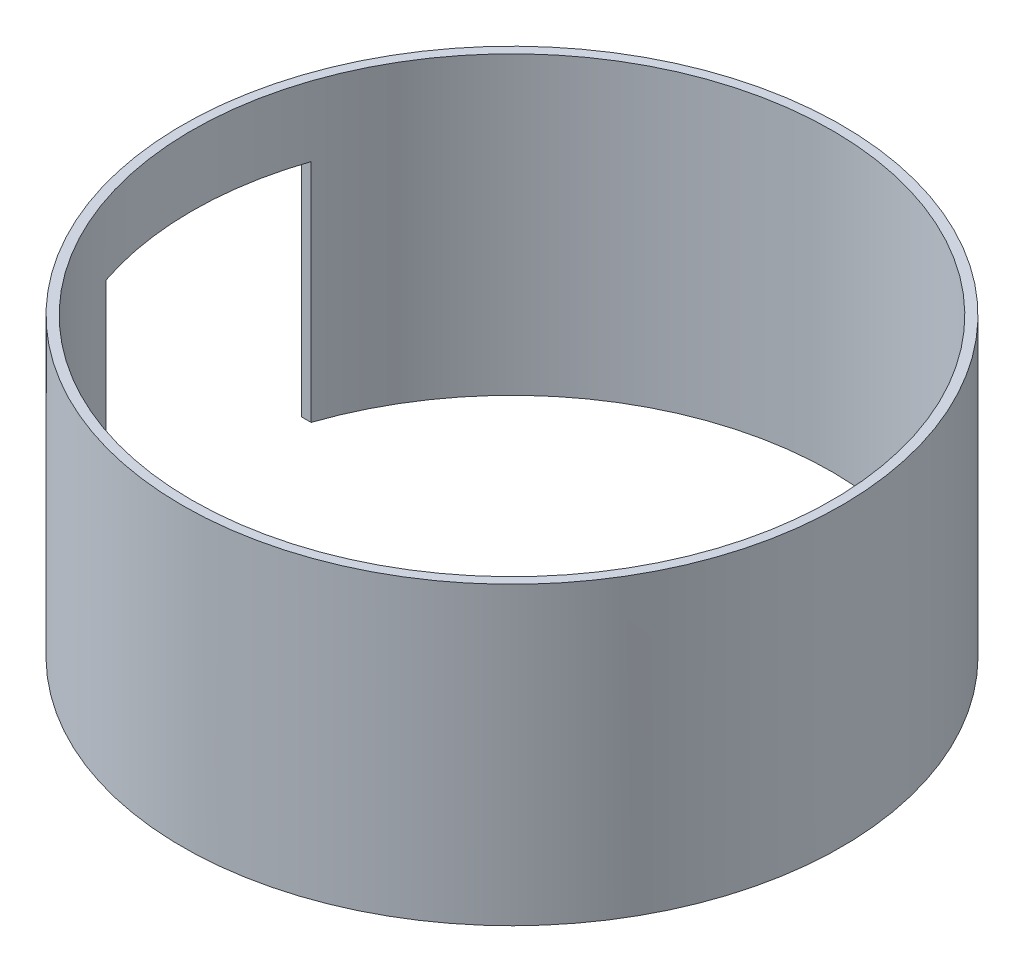
ISO-10303-21;
HEADER;
FILE_DESCRIPTION(('STEP AP214'),'2;1');
FILE_NAME('part.step','',(''),(''),'','','');
FILE_SCHEMA(('AUTOMOTIVE_DESIGN { 1 0 10303 214 1 1 1 1 }'));
ENDSEC;
DATA;
#1=APPLICATION_CONTEXT('core data for automotive mechanical design processes');
#2=APPLICATION_PROTOCOL_DEFINITION('international standard','automotive_design',2000,#1);
#3=PRODUCT_CONTEXT('',#1,'mechanical');
#4=PRODUCT('Part','Part','',(#3));
#5=PRODUCT_RELATED_PRODUCT_CATEGORY('part','',(#4));
#6=PRODUCT_DEFINITION_FORMATION('','',#4);
#7=PRODUCT_DEFINITION_CONTEXT('part definition',#1,'design');
#8=PRODUCT_DEFINITION('design','',#6,#7);
#9=PRODUCT_DEFINITION_SHAPE('','',#8);
#10=(LENGTH_UNIT() NAMED_UNIT(*) SI_UNIT(.MILLI.,.METRE.));
#11=(NAMED_UNIT(*) PLANE_ANGLE_UNIT() SI_UNIT($,.RADIAN.));
#12=(NAMED_UNIT(*) SI_UNIT($,.STERADIAN.) SOLID_ANGLE_UNIT());
#13=UNCERTAINTY_MEASURE_WITH_UNIT(LENGTH_MEASURE(1.E-05),#10,'distance_accuracy_value','');
#14=(GEOMETRIC_REPRESENTATION_CONTEXT(3) GLOBAL_UNCERTAINTY_ASSIGNED_CONTEXT((#13)) GLOBAL_UNIT_ASSIGNED_CONTEXT((#10,
#11,#12)) REPRESENTATION_CONTEXT('',''));
#15=CARTESIAN_POINT('',(0.,0.,0.));
#16=DIRECTION('',(0.,0.,1.));
#17=DIRECTION('',(1.,0.,0.));
#18=AXIS2_PLACEMENT_3D('',#15,#16,#17);
#19=CARTESIAN_POINT('',(0.,31.75,0.));
#20=DIRECTION('',(0.,1.,0.));
#21=DIRECTION('',(0.,0.,1.));
#22=AXIS2_PLACEMENT_3D('',#19,#20,#21);
#23=PLANE('',#22);
#24=CARTESIAN_POINT('',(0.,31.75,0.));
#25=DIRECTION('',(0.,1.,0.));
#26=DIRECTION('',(0.,0.,1.));
#27=AXIS2_PLACEMENT_3D('',#24,#25,#26);
#28=CIRCLE('',#27,35.375);
#29=CARTESIAN_POINT('',(0.,31.75,35.375));
#30=VERTEX_POINT('',#29);
#31=EDGE_CURVE('E104',#30,#30,#28,.T.);
#32=ORIENTED_EDGE('',*,*,#31,.T.);
#33=EDGE_LOOP('',(#32));
#34=FACE_BOUND('',#33,.T.);
#35=CARTESIAN_POINT('',(0.,31.75,0.));
#36=DIRECTION('',(0.,1.,0.));
#37=DIRECTION('',(0.,0.,1.));
#38=AXIS2_PLACEMENT_3D('',#35,#36,#37);
#39=CIRCLE('',#38,34.375);
#40=CARTESIAN_POINT('',(0.,31.75,34.375));
#41=VERTEX_POINT('',#40);
#42=EDGE_CURVE('E98',#41,#41,#39,.T.);
#43=ORIENTED_EDGE('',*,*,#42,.F.);
#44=EDGE_LOOP('',(#43));
#45=FACE_BOUND('',#44,.T.);
#46=ADVANCED_FACE('F39',(#34,#45),#23,.T.);
#47=CARTESIAN_POINT('',(0.,0.,0.));
#48=DIRECTION('',(0.,1.,0.));
#49=DIRECTION('',(0.,0.,1.));
#50=AXIS2_PLACEMENT_3D('',#47,#48,#49);
#51=PLANE('',#50);
#52=CARTESIAN_POINT('',(0.,0.,0.));
#53=DIRECTION('',(0.,1.,0.));
#54=DIRECTION('',(0.,0.,1.));
#55=AXIS2_PLACEMENT_3D('',#52,#53,#54);
#56=CIRCLE('',#55,34.375);
#57=CARTESIAN_POINT('',(-32.5674780263993,0.,11.));
#58=VERTEX_POINT('',#57);
#59=CARTESIAN_POINT('',(-32.5674780263993,0.,-11.));
#60=VERTEX_POINT('',#59);
#61=EDGE_CURVE('E95',#58,#60,#56,.T.);
#62=ORIENTED_EDGE('',*,*,#61,.T.);
#63=DIRECTION('',(1.,0.,0.));
#64=VECTOR('',#63,1.);
#65=CARTESIAN_POINT('',(-43.,0.,-11.));
#66=LINE('',#65,#64);
#67=CARTESIAN_POINT('',(-33.6212823223624,0.,-11.));
#68=VERTEX_POINT('',#67);
#69=EDGE_CURVE('E60',#68,#60,#66,.T.);
#70=ORIENTED_EDGE('',*,*,#69,.F.);
#71=CARTESIAN_POINT('',(0.,0.,0.));
#72=DIRECTION('',(0.,1.,0.));
#73=DIRECTION('',(0.,0.,1.));
#74=AXIS2_PLACEMENT_3D('',#71,#72,#73);
#75=CIRCLE('',#74,35.375);
#76=CARTESIAN_POINT('',(-33.6212823223624,0.,11.));
#77=VERTEX_POINT('',#76);
#78=EDGE_CURVE('E94',#77,#68,#75,.T.);
#79=ORIENTED_EDGE('',*,*,#78,.F.);
#80=DIRECTION('',(1.,0.,0.));
#81=VECTOR('',#80,1.);
#82=CARTESIAN_POINT('',(-43.,0.,11.));
#83=LINE('',#82,#81);
#84=EDGE_CURVE('E113',#77,#58,#83,.T.);
#85=ORIENTED_EDGE('',*,*,#84,.T.);
#86=EDGE_LOOP('',(#62,#70,#79,#85));
#87=FACE_BOUND('',#86,.T.);
#88=ADVANCED_FACE('F117',(#87),#51,.F.);
#89=CARTESIAN_POINT('',(0.,31.75,0.));
#90=DIRECTION('',(0.,-1.,0.));
#91=DIRECTION('',(0.,0.,-1.));
#92=AXIS2_PLACEMENT_3D('',#89,#90,#91);
#93=CYLINDRICAL_SURFACE('',#92,35.375);
#94=ORIENTED_EDGE('',*,*,#78,.T.);
#95=DIRECTION('',(0.,-1.,0.));
#96=VECTOR('',#95,1.);
#97=CARTESIAN_POINT('',(-33.6212823223624,31.75,-11.));
#98=LINE('',#97,#96);
#99=CARTESIAN_POINT('',(-33.6212823223624,24.25,-11.));
#100=VERTEX_POINT('',#99);
#101=EDGE_CURVE('E88',#68,#100,#98,.F.);
#102=ORIENTED_EDGE('',*,*,#101,.T.);
#103=CARTESIAN_POINT('',(0.,24.25,0.));
#104=DIRECTION('',(0.,1.,0.));
#105=DIRECTION('',(0.,0.,1.));
#106=AXIS2_PLACEMENT_3D('',#103,#104,#105);
#107=CIRCLE('',#106,35.375);
#108=CARTESIAN_POINT('',(-33.6212823223624,24.25,11.));
#109=VERTEX_POINT('',#108);
#110=EDGE_CURVE('E78',#100,#109,#107,.T.);
#111=ORIENTED_EDGE('',*,*,#110,.T.);
#112=DIRECTION('',(0.,-1.,0.));
#113=VECTOR('',#112,1.);
#114=CARTESIAN_POINT('',(-33.6212823223624,31.75,11.));
#115=LINE('',#114,#113);
#116=EDGE_CURVE('E85',#109,#77,#115,.T.);
#117=ORIENTED_EDGE('',*,*,#116,.T.);
#118=EDGE_LOOP('',(#94,#102,#111,#117));
#119=FACE_BOUND('',#118,.T.);
#120=ORIENTED_EDGE('',*,*,#31,.F.);
#121=EDGE_LOOP('',(#120));
#122=FACE_BOUND('',#121,.T.);
#123=ADVANCED_FACE('F41',(#119,#122),#93,.T.);
#124=CARTESIAN_POINT('',(0.,31.75,0.));
#125=DIRECTION('',(0.,-1.,0.));
#126=DIRECTION('',(0.,0.,-1.));
#127=AXIS2_PLACEMENT_3D('',#124,#125,#126);
#128=CYLINDRICAL_SURFACE('',#127,34.375);
#129=DIRECTION('',(0.,-1.,0.));
#130=VECTOR('',#129,1.);
#131=CARTESIAN_POINT('',(-32.5674780263993,31.75,-11.));
#132=LINE('',#131,#130);
#133=CARTESIAN_POINT('',(-32.5674780263993,24.25,-11.));
#134=VERTEX_POINT('',#133);
#135=EDGE_CURVE('E11',#60,#134,#132,.F.);
#136=ORIENTED_EDGE('',*,*,#135,.F.);
#137=ORIENTED_EDGE('',*,*,#61,.F.);
#138=DIRECTION('',(0.,-1.,0.));
#139=VECTOR('',#138,1.);
#140=CARTESIAN_POINT('',(-32.5674780263993,31.75,11.));
#141=LINE('',#140,#139);
#142=CARTESIAN_POINT('',(-32.5674780263993,24.25,11.));
#143=VERTEX_POINT('',#142);
#144=EDGE_CURVE('E47',#143,#58,#141,.T.);
#145=ORIENTED_EDGE('',*,*,#144,.F.);
#146=CARTESIAN_POINT('',(0.,24.25,0.));
#147=DIRECTION('',(0.,1.,0.));
#148=DIRECTION('',(0.,0.,1.));
#149=AXIS2_PLACEMENT_3D('',#146,#147,#148);
#150=CIRCLE('',#149,34.375);
#151=EDGE_CURVE('E107',#134,#143,#150,.T.);
#152=ORIENTED_EDGE('',*,*,#151,.F.);
#153=EDGE_LOOP('',(#136,#137,#145,#152));
#154=FACE_BOUND('',#153,.T.);
#155=ORIENTED_EDGE('',*,*,#42,.T.);
#156=EDGE_LOOP('',(#155));
#157=FACE_BOUND('',#156,.T.);
#158=ADVANCED_FACE('F119',(#154,#157),#128,.F.);
#159=CARTESIAN_POINT('',(-43.,24.25,-11.));
#160=DIRECTION('',(0.,0.,-1.));
#161=DIRECTION('',(0.,1.,0.));
#162=AXIS2_PLACEMENT_3D('',#159,#160,#161);
#163=PLANE('',#162);
#164=ORIENTED_EDGE('',*,*,#69,.T.);
#165=ORIENTED_EDGE('',*,*,#135,.T.);
#166=DIRECTION('',(1.,0.,0.));
#167=VECTOR('',#166,1.);
#168=CARTESIAN_POINT('',(-43.,24.25,-11.));
#169=LINE('',#168,#167);
#170=EDGE_CURVE('E54',#100,#134,#169,.T.);
#171=ORIENTED_EDGE('',*,*,#170,.F.);
#172=ORIENTED_EDGE('',*,*,#101,.F.);
#173=EDGE_LOOP('',(#164,#165,#171,#172));
#174=FACE_BOUND('',#173,.T.);
#175=ADVANCED_FACE('F87',(#174),#163,.F.);
#176=CARTESIAN_POINT('',(-43.,24.25,11.));
#177=DIRECTION('',(0.,0.,1.));
#178=DIRECTION('',(0.,-1.,0.));
#179=AXIS2_PLACEMENT_3D('',#176,#177,#178);
#180=PLANE('',#179);
#181=DIRECTION('',(1.,0.,0.));
#182=VECTOR('',#181,1.);
#183=CARTESIAN_POINT('',(-43.,24.25,11.));
#184=LINE('',#183,#182);
#185=EDGE_CURVE('E81',#109,#143,#184,.T.);
#186=ORIENTED_EDGE('',*,*,#185,.T.);
#187=ORIENTED_EDGE('',*,*,#144,.T.);
#188=ORIENTED_EDGE('',*,*,#84,.F.);
#189=ORIENTED_EDGE('',*,*,#116,.F.);
#190=EDGE_LOOP('',(#186,#187,#188,#189));
#191=FACE_BOUND('',#190,.T.);
#192=ADVANCED_FACE('F112',(#191),#180,.F.);
#193=CARTESIAN_POINT('',(-43.,24.25,-11.));
#194=DIRECTION('',(0.,1.,0.));
#195=DIRECTION('',(0.,0.,1.));
#196=AXIS2_PLACEMENT_3D('',#193,#194,#195);
#197=PLANE('',#196);
#198=ORIENTED_EDGE('',*,*,#170,.T.);
#199=ORIENTED_EDGE('',*,*,#151,.T.);
#200=ORIENTED_EDGE('',*,*,#185,.F.);
#201=ORIENTED_EDGE('',*,*,#110,.F.);
#202=EDGE_LOOP('',(#198,#199,#200,#201));
#203=FACE_BOUND('',#202,.T.);
#204=ADVANCED_FACE('F79',(#203),#197,.F.);
#205=CLOSED_SHELL('',(#46,#88,#123,#158,#175,#192,#204));
#206=MANIFOLD_SOLID_BREP('B2',#205);
#207=ADVANCED_BREP_SHAPE_REPRESENTATION('',(#18,#206),#14);
#208=SHAPE_DEFINITION_REPRESENTATION(#9,#207);
ENDSEC;
END-ISO-10303-21;
